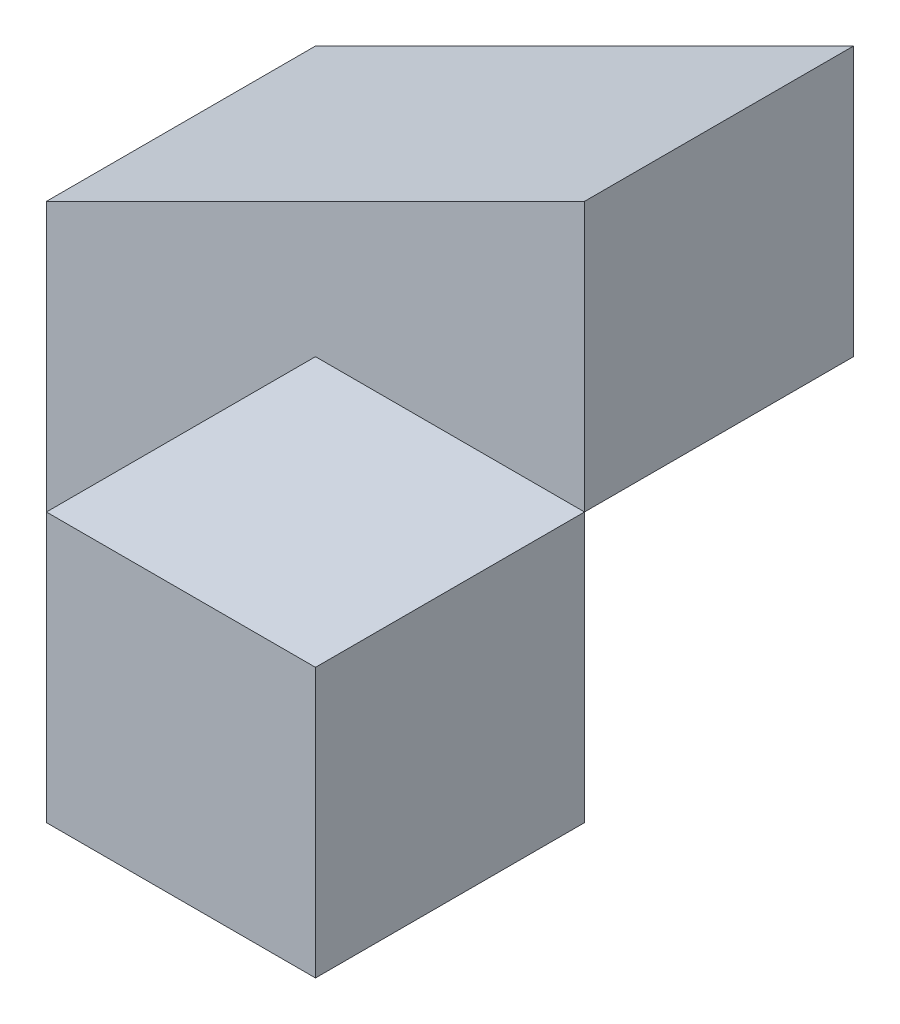
ISO-10303-21;
HEADER;
FILE_DESCRIPTION(('STEP AP214'),'2;1');
FILE_NAME('part.step','',(''),(''),'','','');
FILE_SCHEMA(('AUTOMOTIVE_DESIGN { 1 0 10303 214 1 1 1 1 }'));
ENDSEC;
DATA;
#1=APPLICATION_CONTEXT('core data for automotive mechanical design processes');
#2=APPLICATION_PROTOCOL_DEFINITION('international standard','automotive_design',2000,#1);
#3=PRODUCT_CONTEXT('',#1,'mechanical');
#4=PRODUCT('Part','Part','',(#3));
#5=PRODUCT_RELATED_PRODUCT_CATEGORY('part','',(#4));
#6=PRODUCT_DEFINITION_FORMATION('','',#4);
#7=PRODUCT_DEFINITION_CONTEXT('part definition',#1,'design');
#8=PRODUCT_DEFINITION('design','',#6,#7);
#9=PRODUCT_DEFINITION_SHAPE('','',#8);
#10=(LENGTH_UNIT() NAMED_UNIT(*) SI_UNIT(.MILLI.,.METRE.));
#11=(NAMED_UNIT(*) PLANE_ANGLE_UNIT() SI_UNIT($,.RADIAN.));
#12=(NAMED_UNIT(*) SI_UNIT($,.STERADIAN.) SOLID_ANGLE_UNIT());
#13=UNCERTAINTY_MEASURE_WITH_UNIT(LENGTH_MEASURE(1.E-05),#10,'distance_accuracy_value','');
#14=(GEOMETRIC_REPRESENTATION_CONTEXT(3) GLOBAL_UNCERTAINTY_ASSIGNED_CONTEXT((#13)) GLOBAL_UNIT_ASSIGNED_CONTEXT((#10,
#11,#12)) REPRESENTATION_CONTEXT('',''));
#15=CARTESIAN_POINT('',(0.,0.,0.));
#16=DIRECTION('',(0.,0.,1.));
#17=DIRECTION('',(1.,0.,0.));
#18=AXIS2_PLACEMENT_3D('',#15,#16,#17);
#19=CARTESIAN_POINT('',(40.,0.,40.));
#20=DIRECTION('',(-1.,0.,0.));
#21=DIRECTION('',(0.,0.,1.));
#22=AXIS2_PLACEMENT_3D('',#19,#20,#21);
#23=PLANE('',#22);
#24=DIRECTION('',(0.,0.,1.));
#25=VECTOR('',#24,1.);
#26=CARTESIAN_POINT('',(40.,20.,0.));
#27=LINE('',#26,#25);
#28=CARTESIAN_POINT('',(40.,20.,0.));
#29=VERTEX_POINT('',#28);
#30=CARTESIAN_POINT('',(40.,20.,20.));
#31=VERTEX_POINT('',#30);
#32=EDGE_CURVE('E127',#29,#31,#27,.T.);
#33=ORIENTED_EDGE('',*,*,#32,.F.);
#34=DIRECTION('',(0.,1.,0.));
#35=VECTOR('',#34,1.);
#36=CARTESIAN_POINT('',(40.,0.,0.));
#37=LINE('',#36,#35);
#38=CARTESIAN_POINT('',(40.,40.,0.));
#39=VERTEX_POINT('',#38);
#40=EDGE_CURVE('E156',#29,#39,#37,.T.);
#41=ORIENTED_EDGE('',*,*,#40,.T.);
#42=DIRECTION('',(0.,0.,-1.));
#43=VECTOR('',#42,1.);
#44=CARTESIAN_POINT('',(40.,40.,40.));
#45=LINE('',#44,#43);
#46=CARTESIAN_POINT('',(40.,40.,20.));
#47=VERTEX_POINT('',#46);
#48=EDGE_CURVE('E159',#47,#39,#45,.T.);
#49=ORIENTED_EDGE('',*,*,#48,.F.);
#50=DIRECTION('',(0.,1.,0.));
#51=VECTOR('',#50,1.);
#52=CARTESIAN_POINT('',(40.,40.,20.));
#53=LINE('',#52,#51);
#54=EDGE_CURVE('E141',#31,#47,#53,.T.);
#55=ORIENTED_EDGE('',*,*,#54,.F.);
#56=EDGE_LOOP('',(#33,#41,#49,#55));
#57=FACE_BOUND('',#56,.T.);
#58=ADVANCED_FACE('F33',(#57),#23,.F.);
#59=CARTESIAN_POINT('',(0.,0.,40.));
#60=DIRECTION('',(1.,0.,0.));
#61=DIRECTION('',(0.,0.,-1.));
#62=AXIS2_PLACEMENT_3D('',#59,#60,#61);
#63=PLANE('',#62);
#64=DIRECTION('',(0.,0.,-1.));
#65=VECTOR('',#64,1.);
#66=CARTESIAN_POINT('',(0.,0.,40.));
#67=LINE('',#66,#65);
#68=CARTESIAN_POINT('',(0.,0.,20.));
#69=VERTEX_POINT('',#68);
#70=CARTESIAN_POINT('',(0.,0.,0.));
#71=VERTEX_POINT('',#70);
#72=EDGE_CURVE('E41',#69,#71,#67,.T.);
#73=ORIENTED_EDGE('',*,*,#72,.F.);
#74=DIRECTION('',(0.,1.,0.));
#75=VECTOR('',#74,1.);
#76=CARTESIAN_POINT('',(0.,0.,20.));
#77=LINE('',#76,#75);
#78=CARTESIAN_POINT('',(0.,20.,20.));
#79=VERTEX_POINT('',#78);
#80=EDGE_CURVE('E107',#69,#79,#77,.T.);
#81=ORIENTED_EDGE('',*,*,#80,.T.);
#82=DIRECTION('',(0.,0.,1.));
#83=VECTOR('',#82,1.);
#84=CARTESIAN_POINT('',(0.,20.,0.));
#85=LINE('',#84,#83);
#86=CARTESIAN_POINT('',(0.,20.,0.));
#87=VERTEX_POINT('',#86);
#88=EDGE_CURVE('E150',#87,#79,#85,.T.);
#89=ORIENTED_EDGE('',*,*,#88,.F.);
#90=DIRECTION('',(0.,-1.,0.));
#91=VECTOR('',#90,1.);
#92=CARTESIAN_POINT('',(0.,0.,0.));
#93=LINE('',#92,#91);
#94=EDGE_CURVE('E153',#87,#71,#93,.T.);
#95=ORIENTED_EDGE('',*,*,#94,.T.);
#96=EDGE_LOOP('',(#73,#81,#89,#95));
#97=FACE_BOUND('',#96,.T.);
#98=ADVANCED_FACE('F35',(#97),#63,.F.);
#99=CARTESIAN_POINT('',(0.,0.,40.));
#100=DIRECTION('',(0.,1.,0.));
#101=DIRECTION('',(0.,0.,1.));
#102=AXIS2_PLACEMENT_3D('',#99,#100,#101);
#103=PLANE('',#102);
#104=DIRECTION('',(1.,0.,0.));
#105=VECTOR('',#104,1.);
#106=CARTESIAN_POINT('',(0.,0.,40.));
#107=LINE('',#106,#105);
#108=CARTESIAN_POINT('',(20.,0.,40.));
#109=VERTEX_POINT('',#108);
#110=CARTESIAN_POINT('',(40.,0.,40.));
#111=VERTEX_POINT('',#110);
#112=EDGE_CURVE('E119',#109,#111,#107,.T.);
#113=ORIENTED_EDGE('',*,*,#112,.F.);
#114=DIRECTION('',(0.,0.,-1.));
#115=VECTOR('',#114,1.);
#116=CARTESIAN_POINT('',(20.,0.,20.));
#117=LINE('',#116,#115);
#118=CARTESIAN_POINT('',(20.,0.,20.));
#119=VERTEX_POINT('',#118);
#120=EDGE_CURVE('E103',#109,#119,#117,.T.);
#121=ORIENTED_EDGE('',*,*,#120,.T.);
#122=DIRECTION('',(-1.,0.,0.));
#123=VECTOR('',#122,1.);
#124=CARTESIAN_POINT('',(20.,0.,20.));
#125=LINE('',#124,#123);
#126=EDGE_CURVE('E108',#119,#69,#125,.T.);
#127=ORIENTED_EDGE('',*,*,#126,.T.);
#128=ORIENTED_EDGE('',*,*,#72,.T.);
#129=DIRECTION('',(1.,0.,0.));
#130=VECTOR('',#129,1.);
#131=CARTESIAN_POINT('',(0.,0.,0.));
#132=LINE('',#131,#130);
#133=CARTESIAN_POINT('',(20.,0.,0.));
#134=VERTEX_POINT('',#133);
#135=EDGE_CURVE('E162',#71,#134,#132,.T.);
#136=ORIENTED_EDGE('',*,*,#135,.T.);
#137=DIRECTION('',(-0.707106781186548,0.,-0.707106781186548));
#138=VECTOR('',#137,1.);
#139=CARTESIAN_POINT('',(10.,0.,-10.));
#140=LINE('',#139,#138);
#141=CARTESIAN_POINT('',(40.,0.,20.));
#142=VERTEX_POINT('',#141);
#143=EDGE_CURVE('E125',#142,#134,#140,.T.);
#144=ORIENTED_EDGE('',*,*,#143,.F.);
#145=DIRECTION('',(0.,0.,-1.));
#146=VECTOR('',#145,1.);
#147=CARTESIAN_POINT('',(40.,0.,40.));
#148=LINE('',#147,#146);
#149=EDGE_CURVE('E168',#111,#142,#148,.T.);
#150=ORIENTED_EDGE('',*,*,#149,.F.);
#151=EDGE_LOOP('',(#113,#121,#127,#128,#136,#144,#150));
#152=FACE_BOUND('',#151,.T.);
#153=ADVANCED_FACE('F117',(#152),#103,.F.);
#154=ORIENTED_EDGE('',*,*,#149,.T.);
#155=DIRECTION('',(0.,-1.,0.));
#156=VECTOR('',#155,1.);
#157=CARTESIAN_POINT('',(40.,20.,20.));
#158=LINE('',#157,#156);
#159=EDGE_CURVE('E132',#31,#142,#158,.T.);
#160=ORIENTED_EDGE('',*,*,#159,.F.);
#161=DIRECTION('',(0.,0.,-1.));
#162=VECTOR('',#161,1.);
#163=CARTESIAN_POINT('',(40.,20.,40.));
#164=LINE('',#163,#162);
#165=CARTESIAN_POINT('',(40.,20.,40.));
#166=VERTEX_POINT('',#165);
#167=EDGE_CURVE('E137',#166,#31,#164,.T.);
#168=ORIENTED_EDGE('',*,*,#167,.F.);
#169=DIRECTION('',(0.,1.,0.));
#170=VECTOR('',#169,1.);
#171=CARTESIAN_POINT('',(40.,0.,40.));
#172=LINE('',#171,#170);
#173=EDGE_CURVE('E155',#111,#166,#172,.T.);
#174=ORIENTED_EDGE('',*,*,#173,.F.);
#175=EDGE_LOOP('',(#154,#160,#168,#174));
#176=FACE_BOUND('',#175,.T.);
#177=ADVANCED_FACE('F184',(#176),#23,.F.);
#178=CARTESIAN_POINT('',(0.,0.,40.));
#179=DIRECTION('',(0.,0.,-1.));
#180=DIRECTION('',(-1.,0.,0.));
#181=AXIS2_PLACEMENT_3D('',#178,#179,#180);
#182=PLANE('',#181);
#183=DIRECTION('',(1.,0.,0.));
#184=VECTOR('',#183,1.);
#185=CARTESIAN_POINT('',(0.,20.,40.));
#186=LINE('',#185,#184);
#187=CARTESIAN_POINT('',(20.,20.,40.));
#188=VERTEX_POINT('',#187);
#189=EDGE_CURVE('E143',#188,#166,#186,.T.);
#190=ORIENTED_EDGE('',*,*,#189,.F.);
#191=DIRECTION('',(0.,1.,0.));
#192=VECTOR('',#191,1.);
#193=CARTESIAN_POINT('',(20.,0.,40.));
#194=LINE('',#193,#192);
#195=EDGE_CURVE('E123',#109,#188,#194,.T.);
#196=ORIENTED_EDGE('',*,*,#195,.F.);
#197=ORIENTED_EDGE('',*,*,#112,.T.);
#198=ORIENTED_EDGE('',*,*,#173,.T.);
#199=EDGE_LOOP('',(#190,#196,#197,#198));
#200=FACE_BOUND('',#199,.T.);
#201=ADVANCED_FACE('F188',(#200),#182,.F.);
#202=CARTESIAN_POINT('',(0.,0.,0.));
#203=DIRECTION('',(0.,0.,-1.));
#204=DIRECTION('',(-1.,0.,0.));
#205=AXIS2_PLACEMENT_3D('',#202,#203,#204);
#206=PLANE('',#205);
#207=DIRECTION('',(0.,-1.,0.));
#208=VECTOR('',#207,1.);
#209=CARTESIAN_POINT('',(20.,20.,0.));
#210=LINE('',#209,#208);
#211=CARTESIAN_POINT('',(20.,20.,0.));
#212=VERTEX_POINT('',#211);
#213=EDGE_CURVE('E134',#212,#134,#210,.T.);
#214=ORIENTED_EDGE('',*,*,#213,.T.);
#215=ORIENTED_EDGE('',*,*,#135,.F.);
#216=ORIENTED_EDGE('',*,*,#94,.F.);
#217=DIRECTION('',(0.894427190999916,0.447213595499958,0.));
#218=VECTOR('',#217,1.);
#219=CARTESIAN_POINT('',(40.,40.,0.));
#220=LINE('',#219,#218);
#221=EDGE_CURVE('E146',#87,#39,#220,.T.);
#222=ORIENTED_EDGE('',*,*,#221,.T.);
#223=ORIENTED_EDGE('',*,*,#40,.F.);
#224=DIRECTION('',(1.,0.,0.));
#225=VECTOR('',#224,1.);
#226=CARTESIAN_POINT('',(0.,20.,0.));
#227=LINE('',#226,#225);
#228=EDGE_CURVE('E130',#212,#29,#227,.T.);
#229=ORIENTED_EDGE('',*,*,#228,.F.);
#230=EDGE_LOOP('',(#214,#215,#216,#222,#223,#229));
#231=FACE_BOUND('',#230,.T.);
#232=ADVANCED_FACE('F176',(#231),#206,.T.);
#233=CARTESIAN_POINT('',(40.,40.,0.));
#234=DIRECTION('',(0.447213595499958,-0.894427190999916,0.));
#235=DIRECTION('',(0.894427190999916,0.447213595499958,0.));
#236=AXIS2_PLACEMENT_3D('',#233,#234,#235);
#237=PLANE('',#236);
#238=ORIENTED_EDGE('',*,*,#88,.T.);
#239=DIRECTION('',(0.894427190999916,0.447213595499958,0.));
#240=VECTOR('',#239,1.);
#241=CARTESIAN_POINT('',(40.,40.,20.));
#242=LINE('',#241,#240);
#243=EDGE_CURVE('E11',#79,#47,#242,.T.);
#244=ORIENTED_EDGE('',*,*,#243,.T.);
#245=ORIENTED_EDGE('',*,*,#48,.T.);
#246=ORIENTED_EDGE('',*,*,#221,.F.);
#247=EDGE_LOOP('',(#238,#244,#245,#246));
#248=FACE_BOUND('',#247,.T.);
#249=ADVANCED_FACE('F196',(#248),#237,.F.);
#250=CARTESIAN_POINT('',(0.,40.,20.));
#251=DIRECTION('',(0.,0.,-1.));
#252=DIRECTION('',(0.,1.,0.));
#253=AXIS2_PLACEMENT_3D('',#250,#251,#252);
#254=PLANE('',#253);
#255=ORIENTED_EDGE('',*,*,#243,.F.);
#256=ORIENTED_EDGE('',*,*,#80,.F.);
#257=ORIENTED_EDGE('',*,*,#126,.F.);
#258=DIRECTION('',(0.,1.,0.));
#259=VECTOR('',#258,1.);
#260=CARTESIAN_POINT('',(20.,0.,20.));
#261=LINE('',#260,#259);
#262=CARTESIAN_POINT('',(20.,20.,20.));
#263=VERTEX_POINT('',#262);
#264=EDGE_CURVE('E99',#119,#263,#261,.T.);
#265=ORIENTED_EDGE('',*,*,#264,.T.);
#266=DIRECTION('',(1.,0.,0.));
#267=VECTOR('',#266,1.);
#268=CARTESIAN_POINT('',(0.,20.,20.));
#269=LINE('',#268,#267);
#270=EDGE_CURVE('E144',#263,#31,#269,.T.);
#271=ORIENTED_EDGE('',*,*,#270,.T.);
#272=ORIENTED_EDGE('',*,*,#54,.T.);
#273=EDGE_LOOP('',(#255,#256,#257,#265,#271,#272));
#274=FACE_BOUND('',#273,.T.);
#275=ADVANCED_FACE('F112',(#274),#254,.F.);
#276=CARTESIAN_POINT('',(0.,20.,40.));
#277=DIRECTION('',(0.,-1.,0.));
#278=DIRECTION('',(0.,0.,-1.));
#279=AXIS2_PLACEMENT_3D('',#276,#277,#278);
#280=PLANE('',#279);
#281=ORIENTED_EDGE('',*,*,#270,.F.);
#282=DIRECTION('',(0.,0.,-1.));
#283=VECTOR('',#282,1.);
#284=CARTESIAN_POINT('',(20.,20.,20.));
#285=LINE('',#284,#283);
#286=EDGE_CURVE('E48',#188,#263,#285,.T.);
#287=ORIENTED_EDGE('',*,*,#286,.F.);
#288=ORIENTED_EDGE('',*,*,#189,.T.);
#289=ORIENTED_EDGE('',*,*,#167,.T.);
#290=EDGE_LOOP('',(#281,#287,#288,#289));
#291=FACE_BOUND('',#290,.T.);
#292=ADVANCED_FACE('F190',(#291),#280,.F.);
#293=CARTESIAN_POINT('',(10.,20.,-10.));
#294=DIRECTION('',(-0.707106781186548,0.,0.707106781186548));
#295=DIRECTION('',(0.707106781186548,0.,0.707106781186548));
#296=AXIS2_PLACEMENT_3D('',#293,#294,#295);
#297=PLANE('',#296);
#298=ORIENTED_EDGE('',*,*,#143,.T.);
#299=ORIENTED_EDGE('',*,*,#213,.F.);
#300=DIRECTION('',(-0.707106781186548,0.,-0.707106781186548));
#301=VECTOR('',#300,1.);
#302=CARTESIAN_POINT('',(10.,20.,-10.));
#303=LINE('',#302,#301);
#304=EDGE_CURVE('E56',#31,#212,#303,.T.);
#305=ORIENTED_EDGE('',*,*,#304,.F.);
#306=ORIENTED_EDGE('',*,*,#159,.T.);
#307=EDGE_LOOP('',(#298,#299,#305,#306));
#308=FACE_BOUND('',#307,.T.);
#309=ADVANCED_FACE('F180',(#308),#297,.F.);
#310=CARTESIAN_POINT('',(0.,20.,0.));
#311=DIRECTION('',(0.,-1.,0.));
#312=DIRECTION('',(0.,0.,-1.));
#313=AXIS2_PLACEMENT_3D('',#310,#311,#312);
#314=PLANE('',#313);
#315=ORIENTED_EDGE('',*,*,#32,.T.);
#316=ORIENTED_EDGE('',*,*,#304,.T.);
#317=ORIENTED_EDGE('',*,*,#228,.T.);
#318=EDGE_LOOP('',(#315,#316,#317));
#319=FACE_BOUND('',#318,.T.);
#320=ADVANCED_FACE('F197',(#319),#314,.T.);
#321=CARTESIAN_POINT('',(20.,0.,20.));
#322=DIRECTION('',(1.,0.,0.));
#323=DIRECTION('',(0.,0.,-1.));
#324=AXIS2_PLACEMENT_3D('',#321,#322,#323);
#325=PLANE('',#324);
#326=ORIENTED_EDGE('',*,*,#286,.T.);
#327=ORIENTED_EDGE('',*,*,#264,.F.);
#328=ORIENTED_EDGE('',*,*,#120,.F.);
#329=ORIENTED_EDGE('',*,*,#195,.T.);
#330=EDGE_LOOP('',(#326,#327,#328,#329));
#331=FACE_BOUND('',#330,.T.);
#332=ADVANCED_FACE('F101',(#331),#325,.F.);
#333=CLOSED_SHELL('',(#58,#98,#153,#177,#201,#232,#249,#275,#292,#309,#320,#332));
#334=MANIFOLD_SOLID_BREP('B2',#333);
#335=ADVANCED_BREP_SHAPE_REPRESENTATION('',(#18,#334),#14);
#336=SHAPE_DEFINITION_REPRESENTATION(#9,#335);
ENDSEC;
END-ISO-10303-21;
